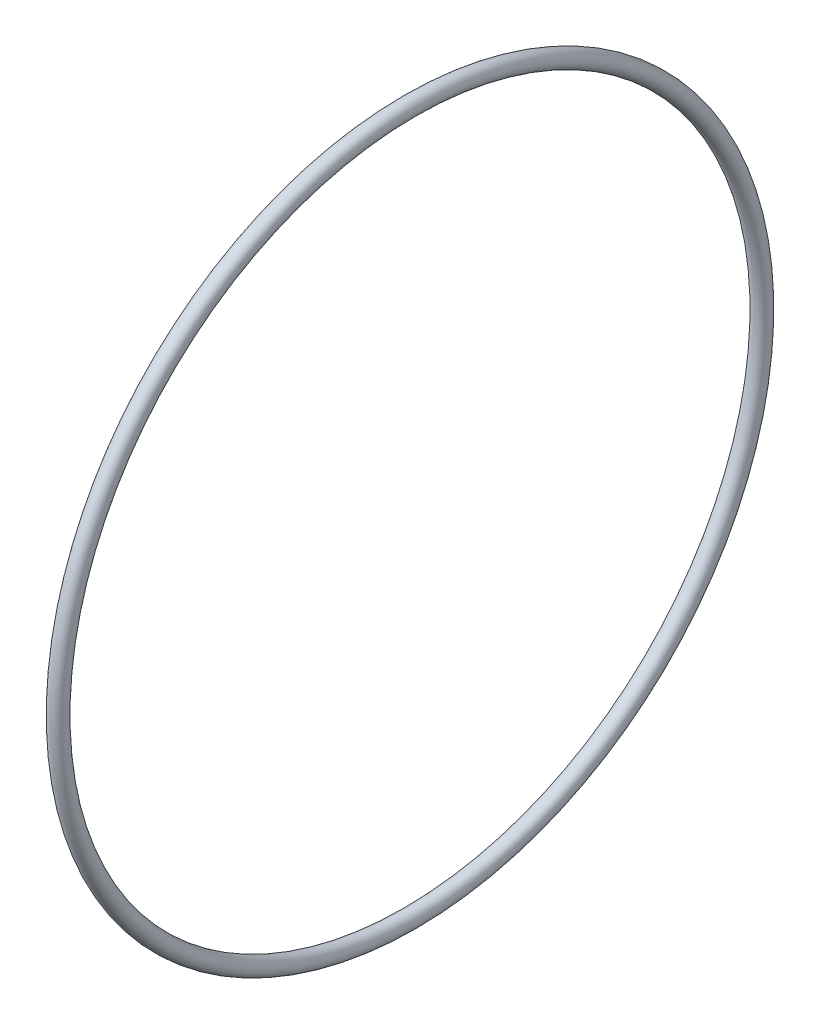
ISO-10303-21;
HEADER;
FILE_DESCRIPTION(('STEP AP214'),'2;1');
FILE_NAME('part.step','',(''),(''),'','','');
FILE_SCHEMA(('AUTOMOTIVE_DESIGN { 1 0 10303 214 1 1 1 1 }'));
ENDSEC;
DATA;
#1=APPLICATION_CONTEXT('core data for automotive mechanical design processes');
#2=APPLICATION_PROTOCOL_DEFINITION('international standard','automotive_design',2000,#1);
#3=PRODUCT_CONTEXT('',#1,'mechanical');
#4=PRODUCT('Part','Part','',(#3));
#5=PRODUCT_RELATED_PRODUCT_CATEGORY('part','',(#4));
#6=PRODUCT_DEFINITION_FORMATION('','',#4);
#7=PRODUCT_DEFINITION_CONTEXT('part definition',#1,'design');
#8=PRODUCT_DEFINITION('design','',#6,#7);
#9=PRODUCT_DEFINITION_SHAPE('','',#8);
#10=(LENGTH_UNIT() NAMED_UNIT(*) SI_UNIT(.MILLI.,.METRE.));
#11=(NAMED_UNIT(*) PLANE_ANGLE_UNIT() SI_UNIT($,.RADIAN.));
#12=(NAMED_UNIT(*) SI_UNIT($,.STERADIAN.) SOLID_ANGLE_UNIT());
#13=UNCERTAINTY_MEASURE_WITH_UNIT(LENGTH_MEASURE(1.E-05),#10,'distance_accuracy_value','');
#14=(GEOMETRIC_REPRESENTATION_CONTEXT(3) GLOBAL_UNCERTAINTY_ASSIGNED_CONTEXT((#13)) GLOBAL_UNIT_ASSIGNED_CONTEXT((#10,
#11,#12)) REPRESENTATION_CONTEXT('',''));
#15=CARTESIAN_POINT('',(0.,0.,0.));
#16=DIRECTION('',(0.,0.,1.));
#17=DIRECTION('',(1.,0.,0.));
#18=AXIS2_PLACEMENT_3D('',#15,#16,#17);
#19=CARTESIAN_POINT('',(-1.638001,0.,0.));
#20=DIRECTION('',(1.,0.,0.));
#21=DIRECTION('',(0.,1.,0.));
#22=AXIS2_PLACEMENT_3D('',#19,#20,#21);
#23=TOROIDAL_SURFACE('',#22,15.699999,0.375);
#24=CARTESIAN_POINT('',(-1.638001,16.074999,0.));
#25=VERTEX_POINT('',#24);
#26=VERTEX_LOOP('',#25);
#27=FACE_BOUND('',#26,.T.);
#28=ADVANCED_FACE('F13',(#27),#23,.T.);
#29=CLOSED_SHELL('',(#28));
#30=CARTESIAN_POINT('',(-1.638001,0.,0.));
#31=DIRECTION('',(1.,0.,0.));
#32=DIRECTION('',(0.,1.,0.));
#33=AXIS2_PLACEMENT_3D('',#30,#31,#32);
#34=TOROIDAL_SURFACE('',#33,15.699999,0.1875);
#35=CARTESIAN_POINT('',(-1.638001,15.887499,0.));
#36=VERTEX_POINT('',#35);
#37=VERTEX_LOOP('',#36);
#38=FACE_BOUND('',#37,.T.);
#39=ADVANCED_FACE('F28',(#38),#34,.F.);
#40=CLOSED_SHELL('',(#39));
#41=ORIENTED_CLOSED_SHELL('',*,#40,.T.);
#42=BREP_WITH_VOIDS('B1',#29,(#41));
#43=ADVANCED_BREP_SHAPE_REPRESENTATION('',(#18,#42),#14);
#44=SHAPE_DEFINITION_REPRESENTATION(#9,#43);
ENDSEC;
END-ISO-10303-21;
